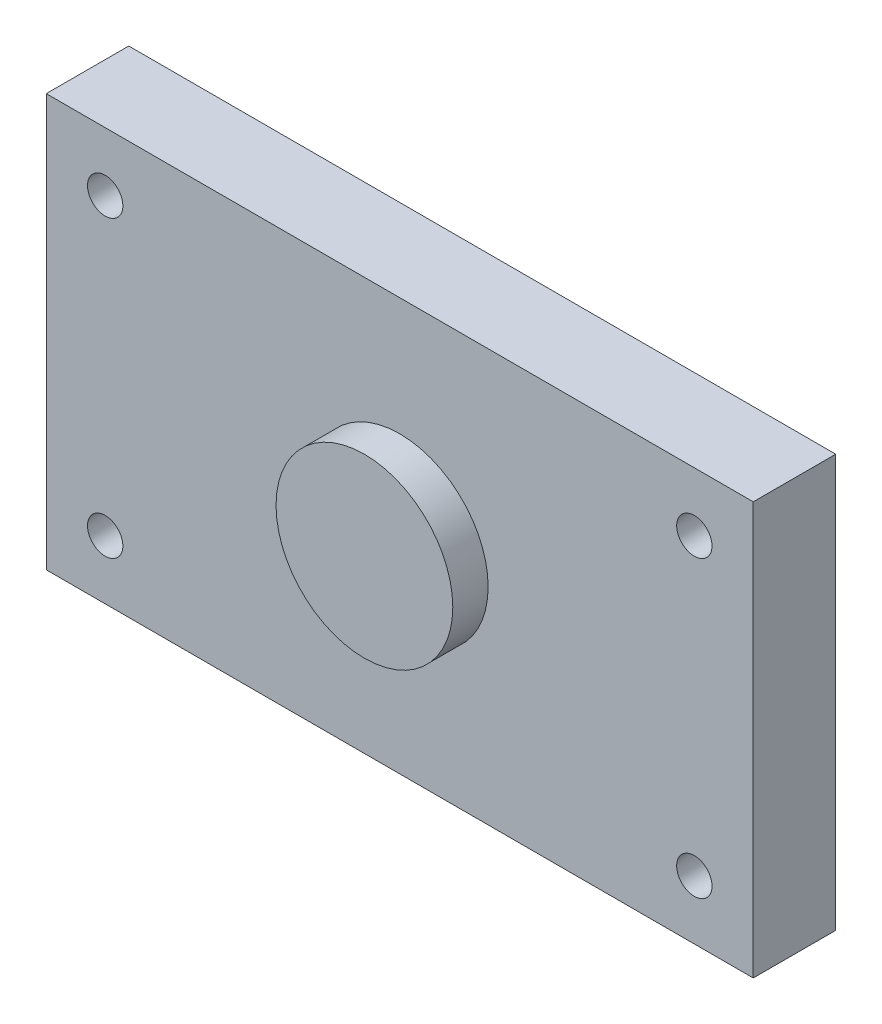
ISO-10303-21;
HEADER;
FILE_DESCRIPTION(('STEP AP214'),'2;1');
FILE_NAME('part.step','',(''),(''),'','','');
FILE_SCHEMA(('AUTOMOTIVE_DESIGN { 1 0 10303 214 1 1 1 1 }'));
ENDSEC;
DATA;
#1=APPLICATION_CONTEXT('core data for automotive mechanical design processes');
#2=APPLICATION_PROTOCOL_DEFINITION('international standard','automotive_design',2000,#1);
#3=PRODUCT_CONTEXT('',#1,'mechanical');
#4=PRODUCT('Part','Part','',(#3));
#5=PRODUCT_RELATED_PRODUCT_CATEGORY('part','',(#4));
#6=PRODUCT_DEFINITION_FORMATION('','',#4);
#7=PRODUCT_DEFINITION_CONTEXT('part definition',#1,'design');
#8=PRODUCT_DEFINITION('design','',#6,#7);
#9=PRODUCT_DEFINITION_SHAPE('','',#8);
#10=(LENGTH_UNIT() NAMED_UNIT(*) SI_UNIT(.MILLI.,.METRE.));
#11=(NAMED_UNIT(*) PLANE_ANGLE_UNIT() SI_UNIT($,.RADIAN.));
#12=(NAMED_UNIT(*) SI_UNIT($,.STERADIAN.) SOLID_ANGLE_UNIT());
#13=UNCERTAINTY_MEASURE_WITH_UNIT(LENGTH_MEASURE(1.E-05),#10,'distance_accuracy_value','');
#14=(GEOMETRIC_REPRESENTATION_CONTEXT(3) GLOBAL_UNCERTAINTY_ASSIGNED_CONTEXT((#13)) GLOBAL_UNIT_ASSIGNED_CONTEXT((#10,
#11,#12)) REPRESENTATION_CONTEXT('',''));
#15=CARTESIAN_POINT('',(0.,0.,0.));
#16=DIRECTION('',(0.,0.,1.));
#17=DIRECTION('',(1.,0.,0.));
#18=AXIS2_PLACEMENT_3D('',#15,#16,#17);
#19=CARTESIAN_POINT('',(-32.5,0.,7.));
#20=DIRECTION('',(1.,0.,0.));
#21=DIRECTION('',(0.,0.,-1.));
#22=AXIS2_PLACEMENT_3D('',#19,#20,#21);
#23=PLANE('',#22);
#24=DIRECTION('',(0.,-1.,0.));
#25=VECTOR('',#24,1.);
#26=CARTESIAN_POINT('',(-32.5,0.,0.));
#27=LINE('',#26,#25);
#28=CARTESIAN_POINT('',(-32.5,17.5,0.));
#29=VERTEX_POINT('',#28);
#30=CARTESIAN_POINT('',(-32.5,-17.5,0.));
#31=VERTEX_POINT('',#30);
#32=EDGE_CURVE('E125',#29,#31,#27,.T.);
#33=ORIENTED_EDGE('',*,*,#32,.F.);
#34=DIRECTION('',(0.,0.,-1.));
#35=VECTOR('',#34,1.);
#36=CARTESIAN_POINT('',(-32.5,17.5,7.));
#37=LINE('',#36,#35);
#38=CARTESIAN_POINT('',(-32.5,17.5,7.));
#39=VERTEX_POINT('',#38);
#40=EDGE_CURVE('E11',#39,#29,#37,.T.);
#41=ORIENTED_EDGE('',*,*,#40,.F.);
#42=DIRECTION('',(0.,-1.,0.));
#43=VECTOR('',#42,1.);
#44=CARTESIAN_POINT('',(-32.5,0.,7.));
#45=LINE('',#44,#43);
#46=CARTESIAN_POINT('',(-32.5,-17.5,7.));
#47=VERTEX_POINT('',#46);
#48=EDGE_CURVE('E105',#39,#47,#45,.T.);
#49=ORIENTED_EDGE('',*,*,#48,.T.);
#50=DIRECTION('',(0.,0.,-1.));
#51=VECTOR('',#50,1.);
#52=CARTESIAN_POINT('',(-32.5,-17.5,7.));
#53=LINE('',#52,#51);
#54=EDGE_CURVE('E82',#47,#31,#53,.T.);
#55=ORIENTED_EDGE('',*,*,#54,.T.);
#56=EDGE_LOOP('',(#33,#41,#49,#55));
#57=FACE_BOUND('',#56,.T.);
#58=ADVANCED_FACE('F41',(#57),#23,.T.);
#59=CARTESIAN_POINT('',(0.,17.5,7.));
#60=DIRECTION('',(0.,1.,0.));
#61=DIRECTION('',(0.,0.,1.));
#62=AXIS2_PLACEMENT_3D('',#59,#60,#61);
#63=PLANE('',#62);
#64=DIRECTION('',(1.,0.,0.));
#65=VECTOR('',#64,1.);
#66=CARTESIAN_POINT('',(0.,17.5,0.));
#67=LINE('',#66,#65);
#68=CARTESIAN_POINT('',(-92.5000000000001,17.5,0.));
#69=VERTEX_POINT('',#68);
#70=EDGE_CURVE('E94',#69,#29,#67,.T.);
#71=ORIENTED_EDGE('',*,*,#70,.F.);
#72=DIRECTION('',(0.,0.,-1.));
#73=VECTOR('',#72,1.);
#74=CARTESIAN_POINT('',(-92.5000000000001,17.5,7.));
#75=LINE('',#74,#73);
#76=CARTESIAN_POINT('',(-92.5000000000001,17.5,7.));
#77=VERTEX_POINT('',#76);
#78=EDGE_CURVE('E51',#77,#69,#75,.T.);
#79=ORIENTED_EDGE('',*,*,#78,.F.);
#80=DIRECTION('',(1.,0.,0.));
#81=VECTOR('',#80,1.);
#82=CARTESIAN_POINT('',(0.,17.5,7.));
#83=LINE('',#82,#81);
#84=EDGE_CURVE('E92',#77,#39,#83,.T.);
#85=ORIENTED_EDGE('',*,*,#84,.T.);
#86=ORIENTED_EDGE('',*,*,#40,.T.);
#87=EDGE_LOOP('',(#71,#79,#85,#86));
#88=FACE_BOUND('',#87,.T.);
#89=ADVANCED_FACE('F90',(#88),#63,.T.);
#90=CARTESIAN_POINT('',(-92.5000000000001,0.,7.));
#91=DIRECTION('',(1.,0.,0.));
#92=DIRECTION('',(0.,0.,-1.));
#93=AXIS2_PLACEMENT_3D('',#90,#91,#92);
#94=PLANE('',#93);
#95=DIRECTION('',(0.,-1.,0.));
#96=VECTOR('',#95,1.);
#97=CARTESIAN_POINT('',(-92.5000000000001,0.,0.));
#98=LINE('',#97,#96);
#99=CARTESIAN_POINT('',(-92.5000000000001,-17.5,0.));
#100=VERTEX_POINT('',#99);
#101=EDGE_CURVE('E128',#69,#100,#98,.T.);
#102=ORIENTED_EDGE('',*,*,#101,.T.);
#103=DIRECTION('',(0.,0.,-1.));
#104=VECTOR('',#103,1.);
#105=CARTESIAN_POINT('',(-92.5000000000001,-17.5,7.));
#106=LINE('',#105,#104);
#107=CARTESIAN_POINT('',(-92.5000000000001,-17.5,7.));
#108=VERTEX_POINT('',#107);
#109=EDGE_CURVE('E97',#108,#100,#106,.T.);
#110=ORIENTED_EDGE('',*,*,#109,.F.);
#111=DIRECTION('',(0.,-1.,0.));
#112=VECTOR('',#111,1.);
#113=CARTESIAN_POINT('',(-92.5000000000001,0.,7.));
#114=LINE('',#113,#112);
#115=EDGE_CURVE('E100',#77,#108,#114,.T.);
#116=ORIENTED_EDGE('',*,*,#115,.F.);
#117=ORIENTED_EDGE('',*,*,#78,.T.);
#118=EDGE_LOOP('',(#102,#110,#116,#117));
#119=FACE_BOUND('',#118,.T.);
#120=ADVANCED_FACE('F101',(#119),#94,.F.);
#121=CARTESIAN_POINT('',(-87.5000000000001,12.5,7.));
#122=DIRECTION('',(0.,0.,-1.));
#123=DIRECTION('',(-1.,0.,0.));
#124=AXIS2_PLACEMENT_3D('',#121,#122,#123);
#125=CYLINDRICAL_SURFACE('',#124,1.5);
#126=CARTESIAN_POINT('',(-87.5000000000001,12.5,7.));
#127=DIRECTION('',(0.,0.,1.));
#128=DIRECTION('',(1.,0.,0.));
#129=AXIS2_PLACEMENT_3D('',#126,#127,#128);
#130=CIRCLE('',#129,1.5);
#131=CARTESIAN_POINT('',(-86.,12.5,7.));
#132=VERTEX_POINT('',#131);
#133=EDGE_CURVE('E112',#132,#132,#130,.T.);
#134=ORIENTED_EDGE('',*,*,#133,.T.);
#135=EDGE_LOOP('',(#134));
#136=FACE_BOUND('',#135,.T.);
#137=CARTESIAN_POINT('',(-87.5000000000001,12.5,0.));
#138=DIRECTION('',(0.,0.,1.));
#139=DIRECTION('',(1.,0.,0.));
#140=AXIS2_PLACEMENT_3D('',#137,#138,#139);
#141=CIRCLE('',#140,1.5);
#142=CARTESIAN_POINT('',(-86.,12.5,0.));
#143=VERTEX_POINT('',#142);
#144=EDGE_CURVE('E131',#143,#143,#141,.T.);
#145=ORIENTED_EDGE('',*,*,#144,.F.);
#146=EDGE_LOOP('',(#145));
#147=FACE_BOUND('',#146,.T.);
#148=ADVANCED_FACE('F159',(#136,#147),#125,.F.);
#149=CARTESIAN_POINT('',(0.,-17.5,7.));
#150=DIRECTION('',(0.,1.,0.));
#151=DIRECTION('',(0.,0.,1.));
#152=AXIS2_PLACEMENT_3D('',#149,#150,#151);
#153=PLANE('',#152);
#154=DIRECTION('',(1.,0.,0.));
#155=VECTOR('',#154,1.);
#156=CARTESIAN_POINT('',(0.,-17.5,0.));
#157=LINE('',#156,#155);
#158=EDGE_CURVE('E75',#100,#31,#157,.T.);
#159=ORIENTED_EDGE('',*,*,#158,.T.);
#160=ORIENTED_EDGE('',*,*,#54,.F.);
#161=DIRECTION('',(1.,0.,0.));
#162=VECTOR('',#161,1.);
#163=CARTESIAN_POINT('',(0.,-17.5,7.));
#164=LINE('',#163,#162);
#165=EDGE_CURVE('E59',#108,#47,#164,.T.);
#166=ORIENTED_EDGE('',*,*,#165,.F.);
#167=ORIENTED_EDGE('',*,*,#109,.T.);
#168=EDGE_LOOP('',(#159,#160,#166,#167));
#169=FACE_BOUND('',#168,.T.);
#170=ADVANCED_FACE('F140',(#169),#153,.F.);
#171=CARTESIAN_POINT('',(-37.5000000000001,12.5,7.));
#172=DIRECTION('',(0.,0.,-1.));
#173=DIRECTION('',(-1.,0.,0.));
#174=AXIS2_PLACEMENT_3D('',#171,#172,#173);
#175=CYLINDRICAL_SURFACE('',#174,1.5);
#176=CARTESIAN_POINT('',(-37.5000000000001,12.5,7.));
#177=DIRECTION('',(0.,0.,1.));
#178=DIRECTION('',(1.,0.,0.));
#179=AXIS2_PLACEMENT_3D('',#176,#177,#178);
#180=CIRCLE('',#179,1.5);
#181=CARTESIAN_POINT('',(-36.,12.5,7.));
#182=VERTEX_POINT('',#181);
#183=EDGE_CURVE('E107',#182,#182,#180,.T.);
#184=ORIENTED_EDGE('',*,*,#183,.T.);
#185=EDGE_LOOP('',(#184));
#186=FACE_BOUND('',#185,.T.);
#187=CARTESIAN_POINT('',(-37.5000000000001,12.5,0.));
#188=DIRECTION('',(0.,0.,1.));
#189=DIRECTION('',(1.,0.,0.));
#190=AXIS2_PLACEMENT_3D('',#187,#188,#189);
#191=CIRCLE('',#190,1.5);
#192=CARTESIAN_POINT('',(-36.,12.5,0.));
#193=VERTEX_POINT('',#192);
#194=EDGE_CURVE('E121',#193,#193,#191,.T.);
#195=ORIENTED_EDGE('',*,*,#194,.F.);
#196=EDGE_LOOP('',(#195));
#197=FACE_BOUND('',#196,.T.);
#198=ADVANCED_FACE('F150',(#186,#197),#175,.F.);
#199=CARTESIAN_POINT('',(-37.5000000000001,-12.5,7.));
#200=DIRECTION('',(0.,0.,-1.));
#201=DIRECTION('',(-1.,0.,0.));
#202=AXIS2_PLACEMENT_3D('',#199,#200,#201);
#203=CYLINDRICAL_SURFACE('',#202,1.5);
#204=CARTESIAN_POINT('',(-37.5000000000001,-12.5,7.));
#205=DIRECTION('',(0.,0.,1.));
#206=DIRECTION('',(1.,0.,0.));
#207=AXIS2_PLACEMENT_3D('',#204,#205,#206);
#208=CIRCLE('',#207,1.5);
#209=CARTESIAN_POINT('',(-36.,-12.5,7.));
#210=VERTEX_POINT('',#209);
#211=EDGE_CURVE('E137',#210,#210,#208,.T.);
#212=ORIENTED_EDGE('',*,*,#211,.T.);
#213=EDGE_LOOP('',(#212));
#214=FACE_BOUND('',#213,.T.);
#215=CARTESIAN_POINT('',(-37.5000000000001,-12.5,0.));
#216=DIRECTION('',(0.,0.,1.));
#217=DIRECTION('',(1.,0.,0.));
#218=AXIS2_PLACEMENT_3D('',#215,#216,#217);
#219=CIRCLE('',#218,1.5);
#220=CARTESIAN_POINT('',(-36.,-12.5,0.));
#221=VERTEX_POINT('',#220);
#222=EDGE_CURVE('E118',#221,#221,#219,.T.);
#223=ORIENTED_EDGE('',*,*,#222,.F.);
#224=EDGE_LOOP('',(#223));
#225=FACE_BOUND('',#224,.T.);
#226=ADVANCED_FACE('F43',(#214,#225),#203,.F.);
#227=CARTESIAN_POINT('',(-87.5000000000001,-12.5,7.));
#228=DIRECTION('',(0.,0.,-1.));
#229=DIRECTION('',(-1.,0.,0.));
#230=AXIS2_PLACEMENT_3D('',#227,#228,#229);
#231=CYLINDRICAL_SURFACE('',#230,1.5);
#232=CARTESIAN_POINT('',(-87.5000000000001,-12.5,7.));
#233=DIRECTION('',(0.,0.,1.));
#234=DIRECTION('',(1.,0.,0.));
#235=AXIS2_PLACEMENT_3D('',#232,#233,#234);
#236=CIRCLE('',#235,1.5);
#237=CARTESIAN_POINT('',(-86.,-12.5,7.));
#238=VERTEX_POINT('',#237);
#239=EDGE_CURVE('E115',#238,#238,#236,.F.);
#240=ORIENTED_EDGE('',*,*,#239,.F.);
#241=EDGE_LOOP('',(#240));
#242=FACE_BOUND('',#241,.T.);
#243=CARTESIAN_POINT('',(-87.5000000000001,-12.5,0.));
#244=DIRECTION('',(0.,0.,1.));
#245=DIRECTION('',(1.,0.,0.));
#246=AXIS2_PLACEMENT_3D('',#243,#244,#245);
#247=CIRCLE('',#246,1.5);
#248=CARTESIAN_POINT('',(-86.,-12.5,0.));
#249=VERTEX_POINT('',#248);
#250=EDGE_CURVE('E134',#249,#249,#247,.F.);
#251=ORIENTED_EDGE('',*,*,#250,.T.);
#252=EDGE_LOOP('',(#251));
#253=FACE_BOUND('',#252,.T.);
#254=ADVANCED_FACE('F157',(#242,#253),#231,.F.);
#255=CARTESIAN_POINT('',(0.,0.,7.));
#256=DIRECTION('',(0.,0.,1.));
#257=DIRECTION('',(1.,0.,0.));
#258=AXIS2_PLACEMENT_3D('',#255,#256,#257);
#259=PLANE('',#258);
#260=CARTESIAN_POINT('',(-62.5000000000001,5.9888800763453E-13,7.));
#261=DIRECTION('',(0.,0.,1.));
#262=DIRECTION('',(1.,0.,0.));
#263=AXIS2_PLACEMENT_3D('',#260,#261,#262);
#264=CIRCLE('',#263,7.50000000000001);
#265=CARTESIAN_POINT('',(-55.,5.9888800763453E-13,7.));
#266=VERTEX_POINT('',#265);
#267=EDGE_CURVE('E272',#266,#266,#264,.T.);
#268=ORIENTED_EDGE('',*,*,#267,.F.);
#269=EDGE_LOOP('',(#268));
#270=FACE_BOUND('',#269,.T.);
#271=ORIENTED_EDGE('',*,*,#211,.F.);
#272=EDGE_LOOP('',(#271));
#273=FACE_BOUND('',#272,.T.);
#274=ORIENTED_EDGE('',*,*,#183,.F.);
#275=EDGE_LOOP('',(#274));
#276=FACE_BOUND('',#275,.T.);
#277=ORIENTED_EDGE('',*,*,#48,.F.);
#278=ORIENTED_EDGE('',*,*,#84,.F.);
#279=ORIENTED_EDGE('',*,*,#115,.T.);
#280=ORIENTED_EDGE('',*,*,#165,.T.);
#281=EDGE_LOOP('',(#277,#278,#279,#280));
#282=FACE_BOUND('',#281,.T.);
#283=ORIENTED_EDGE('',*,*,#133,.F.);
#284=EDGE_LOOP('',(#283));
#285=FACE_BOUND('',#284,.T.);
#286=ORIENTED_EDGE('',*,*,#239,.T.);
#287=EDGE_LOOP('',(#286));
#288=FACE_BOUND('',#287,.T.);
#289=ADVANCED_FACE('F103',(#270,#273,#276,#282,#285,#288),#259,.T.);
#290=CARTESIAN_POINT('',(0.,0.,0.));
#291=DIRECTION('',(0.,0.,1.));
#292=DIRECTION('',(1.,0.,0.));
#293=AXIS2_PLACEMENT_3D('',#290,#291,#292);
#294=PLANE('',#293);
#295=CARTESIAN_POINT('',(-62.5000000000001,5.9888800763453E-13,0.));
#296=DIRECTION('',(0.,0.,1.));
#297=DIRECTION('',(1.,0.,0.));
#298=AXIS2_PLACEMENT_3D('',#295,#296,#297);
#299=CIRCLE('',#298,4.00000000000001);
#300=CARTESIAN_POINT('',(-58.5,5.9888800763453E-13,0.));
#301=VERTEX_POINT('',#300);
#302=EDGE_CURVE('E45',#301,#301,#299,.T.);
#303=ORIENTED_EDGE('',*,*,#302,.T.);
#304=EDGE_LOOP('',(#303));
#305=FACE_BOUND('',#304,.T.);
#306=ORIENTED_EDGE('',*,*,#222,.T.);
#307=EDGE_LOOP('',(#306));
#308=FACE_BOUND('',#307,.T.);
#309=ORIENTED_EDGE('',*,*,#194,.T.);
#310=EDGE_LOOP('',(#309));
#311=FACE_BOUND('',#310,.T.);
#312=ORIENTED_EDGE('',*,*,#32,.T.);
#313=ORIENTED_EDGE('',*,*,#158,.F.);
#314=ORIENTED_EDGE('',*,*,#101,.F.);
#315=ORIENTED_EDGE('',*,*,#70,.T.);
#316=EDGE_LOOP('',(#312,#313,#314,#315));
#317=FACE_BOUND('',#316,.T.);
#318=ORIENTED_EDGE('',*,*,#144,.T.);
#319=EDGE_LOOP('',(#318));
#320=FACE_BOUND('',#319,.T.);
#321=ORIENTED_EDGE('',*,*,#250,.F.);
#322=EDGE_LOOP('',(#321));
#323=FACE_BOUND('',#322,.T.);
#324=ADVANCED_FACE('F141',(#305,#308,#311,#317,#320,#323),#294,.F.);
#325=CARTESIAN_POINT('',(-62.5000000000001,5.9888800763453E-13,10.));
#326=DIRECTION('',(0.,0.,-1.));
#327=DIRECTION('',(-1.,0.,0.));
#328=AXIS2_PLACEMENT_3D('',#325,#326,#327);
#329=CYLINDRICAL_SURFACE('',#328,7.50000000000001);
#330=CARTESIAN_POINT('',(-62.5000000000001,5.9888800763453E-13,10.));
#331=DIRECTION('',(0.,0.,1.));
#332=DIRECTION('',(1.,0.,0.));
#333=AXIS2_PLACEMENT_3D('',#330,#331,#332);
#334=CIRCLE('',#333,7.50000000000001);
#335=CARTESIAN_POINT('',(-55.,5.9888800763453E-13,10.));
#336=VERTEX_POINT('',#335);
#337=EDGE_CURVE('E122',#336,#336,#334,.T.);
#338=ORIENTED_EDGE('',*,*,#337,.F.);
#339=EDGE_LOOP('',(#338));
#340=FACE_BOUND('',#339,.T.);
#341=ORIENTED_EDGE('',*,*,#267,.T.);
#342=EDGE_LOOP('',(#341));
#343=FACE_BOUND('',#342,.T.);
#344=ADVANCED_FACE('F167',(#340,#343),#329,.T.);
#345=CARTESIAN_POINT('',(-62.5000000000001,5.9888800763453E-13,10.));
#346=DIRECTION('',(0.,0.,1.));
#347=DIRECTION('',(1.,0.,0.));
#348=AXIS2_PLACEMENT_3D('',#345,#346,#347);
#349=PLANE('',#348);
#350=ORIENTED_EDGE('',*,*,#337,.T.);
#351=EDGE_LOOP('',(#350));
#352=FACE_BOUND('',#351,.T.);
#353=ADVANCED_FACE('F174',(#352),#349,.T.);
#354=CARTESIAN_POINT('',(-62.5000000000001,5.9888800763453E-13,-3.));
#355=DIRECTION('',(0.,0.,1.));
#356=DIRECTION('',(1.,0.,0.));
#357=AXIS2_PLACEMENT_3D('',#354,#355,#356);
#358=CYLINDRICAL_SURFACE('',#357,4.00000000000001);
#359=CARTESIAN_POINT('',(-62.5000000000001,5.9888800763453E-13,3.));
#360=DIRECTION('',(0.,0.,1.));
#361=DIRECTION('',(1.,0.,0.));
#362=AXIS2_PLACEMENT_3D('',#359,#360,#361);
#363=CIRCLE('',#362,4.00000000000001);
#364=CARTESIAN_POINT('',(-58.5,5.9888800763453E-13,3.));
#365=VERTEX_POINT('',#364);
#366=EDGE_CURVE('E270',#365,#365,#363,.T.);
#367=ORIENTED_EDGE('',*,*,#366,.T.);
#368=EDGE_LOOP('',(#367));
#369=FACE_BOUND('',#368,.T.);
#370=ORIENTED_EDGE('',*,*,#302,.F.);
#371=EDGE_LOOP('',(#370));
#372=FACE_BOUND('',#371,.T.);
#373=ADVANCED_FACE('F237',(#369,#372),#358,.F.);
#374=CARTESIAN_POINT('',(0.,0.,3.));
#375=DIRECTION('',(0.,0.,1.));
#376=DIRECTION('',(1.,0.,0.));
#377=AXIS2_PLACEMENT_3D('',#374,#375,#376);
#378=PLANE('',#377);
#379=ORIENTED_EDGE('',*,*,#366,.F.);
#380=EDGE_LOOP('',(#379));
#381=FACE_BOUND('',#380,.T.);
#382=ADVANCED_FACE('F251',(#381),#378,.F.);
#383=CLOSED_SHELL('',(#58,#89,#120,#148,#170,#198,#226,#254,#289,#324,#344,#353,#373,#382));
#384=MANIFOLD_SOLID_BREP('B2',#383);
#385=ADVANCED_BREP_SHAPE_REPRESENTATION('',(#18,#384),#14);
#386=SHAPE_DEFINITION_REPRESENTATION(#9,#385);
ENDSEC;
END-ISO-10303-21;
